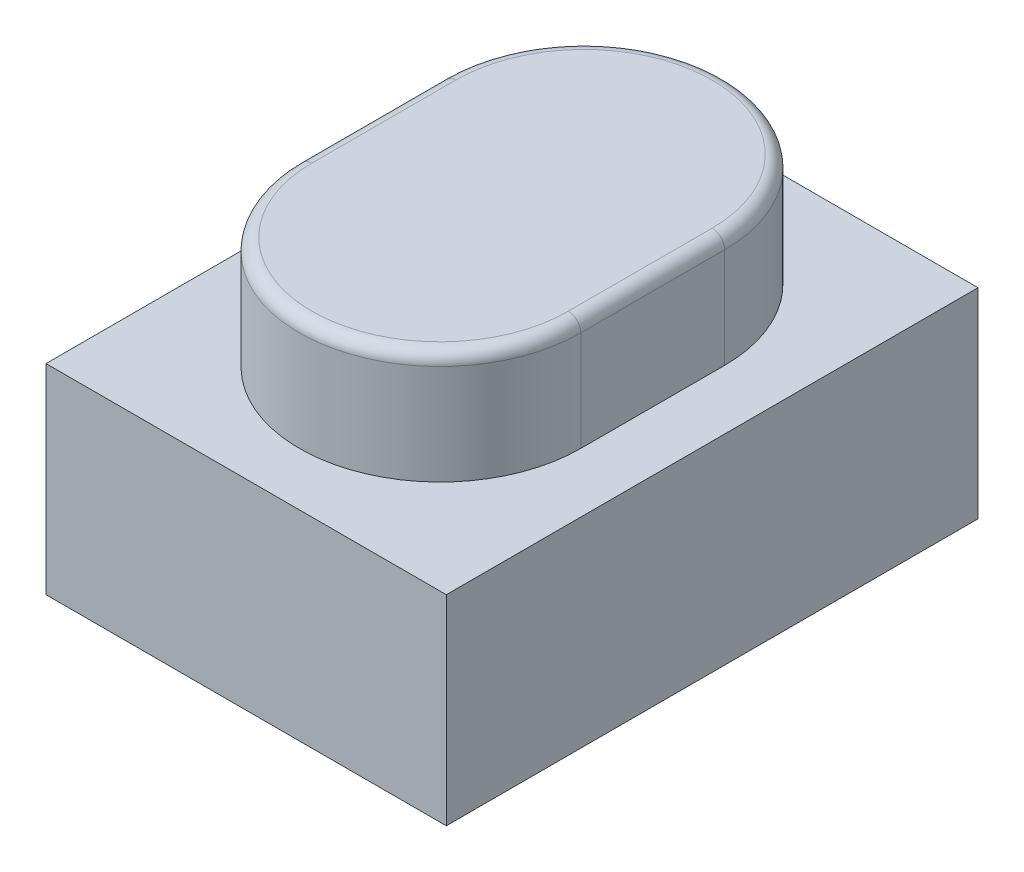
ISO-10303-21;
HEADER;
FILE_DESCRIPTION(('STEP AP214'),'2;1');
FILE_NAME('part.step','',(''),(''),'','','');
FILE_SCHEMA(('AUTOMOTIVE_DESIGN { 1 0 10303 214 1 1 1 1 }'));
ENDSEC;
DATA;
#1=APPLICATION_CONTEXT('core data for automotive mechanical design processes');
#2=APPLICATION_PROTOCOL_DEFINITION('international standard','automotive_design',2000,#1);
#3=PRODUCT_CONTEXT('',#1,'mechanical');
#4=PRODUCT('Part','Part','',(#3));
#5=PRODUCT_RELATED_PRODUCT_CATEGORY('part','',(#4));
#6=PRODUCT_DEFINITION_FORMATION('','',#4);
#7=PRODUCT_DEFINITION_CONTEXT('part definition',#1,'design');
#8=PRODUCT_DEFINITION('design','',#6,#7);
#9=PRODUCT_DEFINITION_SHAPE('','',#8);
#10=(LENGTH_UNIT() NAMED_UNIT(*) SI_UNIT(.MILLI.,.METRE.));
#11=(NAMED_UNIT(*) PLANE_ANGLE_UNIT() SI_UNIT($,.RADIAN.));
#12=(NAMED_UNIT(*) SI_UNIT($,.STERADIAN.) SOLID_ANGLE_UNIT());
#13=UNCERTAINTY_MEASURE_WITH_UNIT(LENGTH_MEASURE(1.E-05),#10,'distance_accuracy_value','');
#14=(GEOMETRIC_REPRESENTATION_CONTEXT(3) GLOBAL_UNCERTAINTY_ASSIGNED_CONTEXT((#13)) GLOBAL_UNIT_ASSIGNED_CONTEXT((#10,
#11,#12)) REPRESENTATION_CONTEXT('',''));
#15=CARTESIAN_POINT('',(0.,0.,0.));
#16=DIRECTION('',(0.,0.,1.));
#17=DIRECTION('',(1.,0.,0.));
#18=AXIS2_PLACEMENT_3D('',#15,#16,#17);
#19=CARTESIAN_POINT('',(1.6,1.6,-2.125));
#20=DIRECTION('',(-1.,0.,0.));
#21=DIRECTION('',(0.,0.,1.));
#22=AXIS2_PLACEMENT_3D('',#19,#20,#21);
#23=PLANE('',#22);
#24=DIRECTION('',(0.,0.,-1.));
#25=VECTOR('',#24,1.);
#26=CARTESIAN_POINT('',(1.6,0.,-2.125));
#27=LINE('',#26,#25);
#28=CARTESIAN_POINT('',(1.6,0.,2.125));
#29=VERTEX_POINT('',#28);
#30=CARTESIAN_POINT('',(1.6,0.,-2.125));
#31=VERTEX_POINT('',#30);
#32=EDGE_CURVE('E150',#29,#31,#27,.T.);
#33=ORIENTED_EDGE('',*,*,#32,.T.);
#34=DIRECTION('',(0.,-1.,0.));
#35=VECTOR('',#34,1.);
#36=CARTESIAN_POINT('',(1.6,1.6,-2.125));
#37=LINE('',#36,#35);
#38=CARTESIAN_POINT('',(1.6,1.6,-2.125));
#39=VERTEX_POINT('',#38);
#40=EDGE_CURVE('E177',#39,#31,#37,.T.);
#41=ORIENTED_EDGE('',*,*,#40,.F.);
#42=DIRECTION('',(0.,0.,-1.));
#43=VECTOR('',#42,1.);
#44=CARTESIAN_POINT('',(1.6,1.6,-2.125));
#45=LINE('',#44,#43);
#46=CARTESIAN_POINT('',(1.6,1.6,2.125));
#47=VERTEX_POINT('',#46);
#48=EDGE_CURVE('E151',#47,#39,#45,.T.);
#49=ORIENTED_EDGE('',*,*,#48,.F.);
#50=DIRECTION('',(0.,-1.,0.));
#51=VECTOR('',#50,1.);
#52=CARTESIAN_POINT('',(1.6,1.6,2.125));
#53=LINE('',#52,#51);
#54=EDGE_CURVE('E161',#47,#29,#53,.T.);
#55=ORIENTED_EDGE('',*,*,#54,.T.);
#56=EDGE_LOOP('',(#33,#41,#49,#55));
#57=FACE_BOUND('',#56,.T.);
#58=ADVANCED_FACE('F45',(#57),#23,.F.);
#59=CARTESIAN_POINT('',(-1.6,1.6,-2.125));
#60=DIRECTION('',(0.,0.,1.));
#61=DIRECTION('',(1.,0.,0.));
#62=AXIS2_PLACEMENT_3D('',#59,#60,#61);
#63=PLANE('',#62);
#64=DIRECTION('',(-1.,0.,0.));
#65=VECTOR('',#64,1.);
#66=CARTESIAN_POINT('',(-1.6,0.,-2.125));
#67=LINE('',#66,#65);
#68=CARTESIAN_POINT('',(-1.6,0.,-2.125));
#69=VERTEX_POINT('',#68);
#70=EDGE_CURVE('E164',#31,#69,#67,.T.);
#71=ORIENTED_EDGE('',*,*,#70,.T.);
#72=DIRECTION('',(0.,-1.,0.));
#73=VECTOR('',#72,1.);
#74=CARTESIAN_POINT('',(-1.6,1.6,-2.125));
#75=LINE('',#74,#73);
#76=CARTESIAN_POINT('',(-1.6,1.6,-2.125));
#77=VERTEX_POINT('',#76);
#78=EDGE_CURVE('E174',#77,#69,#75,.T.);
#79=ORIENTED_EDGE('',*,*,#78,.F.);
#80=DIRECTION('',(-1.,0.,0.));
#81=VECTOR('',#80,1.);
#82=CARTESIAN_POINT('',(-1.6,1.6,-2.125));
#83=LINE('',#82,#81);
#84=EDGE_CURVE('E154',#39,#77,#83,.T.);
#85=ORIENTED_EDGE('',*,*,#84,.F.);
#86=ORIENTED_EDGE('',*,*,#40,.T.);
#87=EDGE_LOOP('',(#71,#79,#85,#86));
#88=FACE_BOUND('',#87,.T.);
#89=ADVANCED_FACE('F232',(#88),#63,.F.);
#90=CARTESIAN_POINT('',(-1.6,1.6,-2.125));
#91=DIRECTION('',(1.,0.,0.));
#92=DIRECTION('',(0.,0.,-1.));
#93=AXIS2_PLACEMENT_3D('',#90,#91,#92);
#94=PLANE('',#93);
#95=DIRECTION('',(0.,0.,1.));
#96=VECTOR('',#95,1.);
#97=CARTESIAN_POINT('',(-1.6,0.,-2.125));
#98=LINE('',#97,#96);
#99=CARTESIAN_POINT('',(-1.6,0.,2.125));
#100=VERTEX_POINT('',#99);
#101=EDGE_CURVE('E166',#69,#100,#98,.T.);
#102=ORIENTED_EDGE('',*,*,#101,.T.);
#103=DIRECTION('',(0.,-1.,0.));
#104=VECTOR('',#103,1.);
#105=CARTESIAN_POINT('',(-1.6,1.6,2.125));
#106=LINE('',#105,#104);
#107=CARTESIAN_POINT('',(-1.6,1.6,2.125));
#108=VERTEX_POINT('',#107);
#109=EDGE_CURVE('E171',#108,#100,#106,.T.);
#110=ORIENTED_EDGE('',*,*,#109,.F.);
#111=DIRECTION('',(0.,0.,1.));
#112=VECTOR('',#111,1.);
#113=CARTESIAN_POINT('',(-1.6,1.6,-2.125));
#114=LINE('',#113,#112);
#115=EDGE_CURVE('E157',#77,#108,#114,.T.);
#116=ORIENTED_EDGE('',*,*,#115,.F.);
#117=ORIENTED_EDGE('',*,*,#78,.T.);
#118=EDGE_LOOP('',(#102,#110,#116,#117));
#119=FACE_BOUND('',#118,.T.);
#120=ADVANCED_FACE('F238',(#119),#94,.F.);
#121=CARTESIAN_POINT('',(-1.6,1.6,2.125));
#122=DIRECTION('',(0.,0.,-1.));
#123=DIRECTION('',(-1.,0.,0.));
#124=AXIS2_PLACEMENT_3D('',#121,#122,#123);
#125=PLANE('',#124);
#126=DIRECTION('',(1.,0.,0.));
#127=VECTOR('',#126,1.);
#128=CARTESIAN_POINT('',(-1.6,0.,2.125));
#129=LINE('',#128,#127);
#130=EDGE_CURVE('E155',#100,#29,#129,.T.);
#131=ORIENTED_EDGE('',*,*,#130,.T.);
#132=ORIENTED_EDGE('',*,*,#54,.F.);
#133=DIRECTION('',(1.,0.,0.));
#134=VECTOR('',#133,1.);
#135=CARTESIAN_POINT('',(-1.6,1.6,2.125));
#136=LINE('',#135,#134);
#137=EDGE_CURVE('E159',#108,#47,#136,.T.);
#138=ORIENTED_EDGE('',*,*,#137,.F.);
#139=ORIENTED_EDGE('',*,*,#109,.T.);
#140=EDGE_LOOP('',(#131,#132,#138,#139));
#141=FACE_BOUND('',#140,.T.);
#142=ADVANCED_FACE('F328',(#141),#125,.F.);
#143=CARTESIAN_POINT('',(0.,1.6,0.));
#144=DIRECTION('',(0.,1.,0.));
#145=DIRECTION('',(0.,0.,1.));
#146=AXIS2_PLACEMENT_3D('',#143,#144,#145);
#147=PLANE('',#146);
#148=CARTESIAN_POINT('',(0.,1.6,-0.575));
#149=DIRECTION('',(0.,1.,0.));
#150=DIRECTION('',(0.,0.,1.));
#151=AXIS2_PLACEMENT_3D('',#148,#149,#150);
#152=CIRCLE('',#151,1.125);
#153=CARTESIAN_POINT('',(1.125,1.6,-0.575000000000001));
#154=VERTEX_POINT('',#153);
#155=CARTESIAN_POINT('',(-1.125,1.6,-0.575));
#156=VERTEX_POINT('',#155);
#157=EDGE_CURVE('E141',#154,#156,#152,.T.);
#158=ORIENTED_EDGE('',*,*,#157,.F.);
#159=DIRECTION('',(0.,0.,-1.));
#160=VECTOR('',#159,1.);
#161=CARTESIAN_POINT('',(1.125,1.6,-0.575000000000001));
#162=LINE('',#161,#160);
#163=CARTESIAN_POINT('',(1.125,1.6,0.575));
#164=VERTEX_POINT('',#163);
#165=EDGE_CURVE('E138',#164,#154,#162,.T.);
#166=ORIENTED_EDGE('',*,*,#165,.F.);
#167=CARTESIAN_POINT('',(0.,1.6,0.575));
#168=DIRECTION('',(0.,1.,0.));
#169=DIRECTION('',(0.,0.,1.));
#170=AXIS2_PLACEMENT_3D('',#167,#168,#169);
#171=CIRCLE('',#170,1.125);
#172=CARTESIAN_POINT('',(-1.125,1.6,0.575));
#173=VERTEX_POINT('',#172);
#174=EDGE_CURVE('E124',#173,#164,#171,.T.);
#175=ORIENTED_EDGE('',*,*,#174,.F.);
#176=DIRECTION('',(0.,0.,1.));
#177=VECTOR('',#176,1.);
#178=CARTESIAN_POINT('',(-1.125,1.6,-0.575));
#179=LINE('',#178,#177);
#180=EDGE_CURVE('E135',#156,#173,#179,.T.);
#181=ORIENTED_EDGE('',*,*,#180,.F.);
#182=EDGE_LOOP('',(#158,#166,#175,#181));
#183=FACE_BOUND('',#182,.T.);
#184=ORIENTED_EDGE('',*,*,#48,.T.);
#185=ORIENTED_EDGE('',*,*,#84,.T.);
#186=ORIENTED_EDGE('',*,*,#115,.T.);
#187=ORIENTED_EDGE('',*,*,#137,.T.);
#188=EDGE_LOOP('',(#184,#185,#186,#187));
#189=FACE_BOUND('',#188,.T.);
#190=ADVANCED_FACE('F133',(#183,#189),#147,.T.);
#191=CARTESIAN_POINT('',(0.,0.,0.));
#192=DIRECTION('',(0.,1.,0.));
#193=DIRECTION('',(0.,0.,1.));
#194=AXIS2_PLACEMENT_3D('',#191,#192,#193);
#195=PLANE('',#194);
#196=ORIENTED_EDGE('',*,*,#32,.F.);
#197=ORIENTED_EDGE('',*,*,#130,.F.);
#198=ORIENTED_EDGE('',*,*,#101,.F.);
#199=ORIENTED_EDGE('',*,*,#70,.F.);
#200=EDGE_LOOP('',(#196,#197,#198,#199));
#201=FACE_BOUND('',#200,.T.);
#202=ADVANCED_FACE('F316',(#201),#195,.F.);
#203=CARTESIAN_POINT('',(0.,2.5,-0.575));
#204=DIRECTION('',(0.,-1.,0.));
#205=DIRECTION('',(0.,0.,-1.));
#206=AXIS2_PLACEMENT_3D('',#203,#204,#205);
#207=CYLINDRICAL_SURFACE('',#206,1.125);
#208=DIRECTION('',(0.,-1.,0.));
#209=VECTOR('',#208,1.);
#210=CARTESIAN_POINT('',(-1.125,2.5,-0.575));
#211=LINE('',#210,#209);
#212=CARTESIAN_POINT('',(-1.125,2.4,-0.575));
#213=VERTEX_POINT('',#212);
#214=EDGE_CURVE('E126',#213,#156,#211,.T.);
#215=ORIENTED_EDGE('',*,*,#214,.F.);
#216=CARTESIAN_POINT('',(0.,2.4,-0.575));
#217=DIRECTION('',(0.,1.,0.));
#218=DIRECTION('',(0.,0.,1.));
#219=AXIS2_PLACEMENT_3D('',#216,#217,#218);
#220=CIRCLE('',#219,1.125);
#221=CARTESIAN_POINT('',(1.125,2.4,-0.575000000000001));
#222=VERTEX_POINT('',#221);
#223=EDGE_CURVE('E11',#213,#222,#220,.F.);
#224=ORIENTED_EDGE('',*,*,#223,.T.);
#225=DIRECTION('',(0.,-1.,0.));
#226=VECTOR('',#225,1.);
#227=CARTESIAN_POINT('',(1.125,2.5,-0.575000000000001));
#228=LINE('',#227,#226);
#229=EDGE_CURVE('E146',#222,#154,#228,.T.);
#230=ORIENTED_EDGE('',*,*,#229,.T.);
#231=ORIENTED_EDGE('',*,*,#157,.T.);
#232=EDGE_LOOP('',(#215,#224,#230,#231));
#233=FACE_BOUND('',#232,.T.);
#234=ADVANCED_FACE('F215',(#233),#207,.T.);
#235=CARTESIAN_POINT('',(-1.125,2.5,-0.575));
#236=DIRECTION('',(1.,0.,0.));
#237=DIRECTION('',(0.,0.,-1.));
#238=AXIS2_PLACEMENT_3D('',#235,#236,#237);
#239=PLANE('',#238);
#240=DIRECTION('',(0.,-1.,0.));
#241=VECTOR('',#240,1.);
#242=CARTESIAN_POINT('',(-1.125,2.5,0.575));
#243=LINE('',#242,#241);
#244=CARTESIAN_POINT('',(-1.125,2.4,0.575));
#245=VERTEX_POINT('',#244);
#246=EDGE_CURVE('E121',#245,#173,#243,.T.);
#247=ORIENTED_EDGE('',*,*,#246,.F.);
#248=DIRECTION('',(0.,0.,1.));
#249=VECTOR('',#248,1.);
#250=CARTESIAN_POINT('',(-1.125,2.4,-0.575));
#251=LINE('',#250,#249);
#252=EDGE_CURVE('E54',#245,#213,#251,.F.);
#253=ORIENTED_EDGE('',*,*,#252,.T.);
#254=ORIENTED_EDGE('',*,*,#214,.T.);
#255=ORIENTED_EDGE('',*,*,#180,.T.);
#256=EDGE_LOOP('',(#247,#253,#254,#255));
#257=FACE_BOUND('',#256,.T.);
#258=ADVANCED_FACE('F140',(#257),#239,.F.);
#259=CARTESIAN_POINT('',(0.,2.5,0.575));
#260=DIRECTION('',(0.,-1.,0.));
#261=DIRECTION('',(0.,0.,-1.));
#262=AXIS2_PLACEMENT_3D('',#259,#260,#261);
#263=CYLINDRICAL_SURFACE('',#262,1.125);
#264=DIRECTION('',(0.,-1.,0.));
#265=VECTOR('',#264,1.);
#266=CARTESIAN_POINT('',(1.125,2.5,0.575));
#267=LINE('',#266,#265);
#268=CARTESIAN_POINT('',(1.125,2.4,0.575));
#269=VERTEX_POINT('',#268);
#270=EDGE_CURVE('E127',#269,#164,#267,.T.);
#271=ORIENTED_EDGE('',*,*,#270,.F.);
#272=CARTESIAN_POINT('',(0.,2.4,0.575));
#273=DIRECTION('',(0.,1.,0.));
#274=DIRECTION('',(0.,0.,1.));
#275=AXIS2_PLACEMENT_3D('',#272,#273,#274);
#276=CIRCLE('',#275,1.125);
#277=EDGE_CURVE('E69',#269,#245,#276,.F.);
#278=ORIENTED_EDGE('',*,*,#277,.T.);
#279=ORIENTED_EDGE('',*,*,#246,.T.);
#280=ORIENTED_EDGE('',*,*,#174,.T.);
#281=EDGE_LOOP('',(#271,#278,#279,#280));
#282=FACE_BOUND('',#281,.T.);
#283=ADVANCED_FACE('F123',(#282),#263,.T.);
#284=CARTESIAN_POINT('',(1.125,2.5,-0.575000000000001));
#285=DIRECTION('',(-1.,0.,0.));
#286=DIRECTION('',(0.,0.,1.));
#287=AXIS2_PLACEMENT_3D('',#284,#285,#286);
#288=PLANE('',#287);
#289=ORIENTED_EDGE('',*,*,#229,.F.);
#290=DIRECTION('',(0.,0.,-1.));
#291=VECTOR('',#290,1.);
#292=CARTESIAN_POINT('',(1.125,2.4,0.575));
#293=LINE('',#292,#291);
#294=EDGE_CURVE('E189',#222,#269,#293,.F.);
#295=ORIENTED_EDGE('',*,*,#294,.T.);
#296=ORIENTED_EDGE('',*,*,#270,.T.);
#297=ORIENTED_EDGE('',*,*,#165,.T.);
#298=EDGE_LOOP('',(#289,#295,#296,#297));
#299=FACE_BOUND('',#298,.T.);
#300=ADVANCED_FACE('F218',(#299),#288,.F.);
#301=CARTESIAN_POINT('',(0.,2.5,-0.575));
#302=DIRECTION('',(0.,1.,0.));
#303=DIRECTION('',(0.,0.,1.));
#304=AXIS2_PLACEMENT_3D('',#301,#302,#303);
#305=PLANE('',#304);
#306=CARTESIAN_POINT('',(0.,2.5,0.575));
#307=DIRECTION('',(0.,1.,0.));
#308=DIRECTION('',(0.,0.,1.));
#309=AXIS2_PLACEMENT_3D('',#306,#307,#308);
#310=CIRCLE('',#309,1.025);
#311=CARTESIAN_POINT('',(-1.025,2.5,0.575));
#312=VERTEX_POINT('',#311);
#313=CARTESIAN_POINT('',(1.025,2.5,0.575));
#314=VERTEX_POINT('',#313);
#315=EDGE_CURVE('E184',#312,#314,#310,.T.);
#316=ORIENTED_EDGE('',*,*,#315,.T.);
#317=DIRECTION('',(0.,0.,-1.));
#318=VECTOR('',#317,1.);
#319=CARTESIAN_POINT('',(1.025,2.5,-0.575000000000001));
#320=LINE('',#319,#318);
#321=CARTESIAN_POINT('',(1.025,2.5,-0.575000000000001));
#322=VERTEX_POINT('',#321);
#323=EDGE_CURVE('E186',#314,#322,#320,.T.);
#324=ORIENTED_EDGE('',*,*,#323,.T.);
#325=CARTESIAN_POINT('',(0.,2.5,-0.575));
#326=DIRECTION('',(0.,1.,0.));
#327=DIRECTION('',(0.,0.,1.));
#328=AXIS2_PLACEMENT_3D('',#325,#326,#327);
#329=CIRCLE('',#328,1.025);
#330=CARTESIAN_POINT('',(-1.025,2.5,-0.575));
#331=VERTEX_POINT('',#330);
#332=EDGE_CURVE('E180',#322,#331,#329,.T.);
#333=ORIENTED_EDGE('',*,*,#332,.T.);
#334=DIRECTION('',(0.,0.,1.));
#335=VECTOR('',#334,1.);
#336=CARTESIAN_POINT('',(-1.025,2.5,0.575));
#337=LINE('',#336,#335);
#338=EDGE_CURVE('E182',#331,#312,#337,.T.);
#339=ORIENTED_EDGE('',*,*,#338,.T.);
#340=EDGE_LOOP('',(#316,#324,#333,#339));
#341=FACE_BOUND('',#340,.T.);
#342=ADVANCED_FACE('F223',(#341),#305,.T.);
#343=CARTESIAN_POINT('',(-1.025,2.4,-0.575));
#344=DIRECTION('',(0.,0.,-1.));
#345=DIRECTION('',(-1.,0.,0.));
#346=AXIS2_PLACEMENT_3D('',#343,#344,#345);
#347=CYLINDRICAL_SURFACE('',#346,0.1);
#348=CARTESIAN_POINT('',(-1.025,2.4,-0.575));
#349=DIRECTION('',(0.,0.,-1.));
#350=DIRECTION('',(-1.,0.,0.));
#351=AXIS2_PLACEMENT_3D('',#348,#349,#350);
#352=CIRCLE('',#351,0.1);
#353=EDGE_CURVE('E197',#213,#331,#352,.T.);
#354=ORIENTED_EDGE('',*,*,#353,.F.);
#355=ORIENTED_EDGE('',*,*,#252,.F.);
#356=CARTESIAN_POINT('',(-1.025,2.4,0.575));
#357=DIRECTION('',(0.,0.,1.));
#358=DIRECTION('',(1.,0.,0.));
#359=AXIS2_PLACEMENT_3D('',#356,#357,#358);
#360=CIRCLE('',#359,0.1);
#361=EDGE_CURVE('E49',#312,#245,#360,.T.);
#362=ORIENTED_EDGE('',*,*,#361,.F.);
#363=ORIENTED_EDGE('',*,*,#338,.F.);
#364=EDGE_LOOP('',(#354,#355,#362,#363));
#365=FACE_BOUND('',#364,.T.);
#366=ADVANCED_FACE('F47',(#365),#347,.T.);
#367=CARTESIAN_POINT('',(0.,2.4,0.575));
#368=DIRECTION('',(0.,1.,0.));
#369=DIRECTION('',(0.,0.,1.));
#370=AXIS2_PLACEMENT_3D('',#367,#368,#369);
#371=TOROIDAL_SURFACE('',#370,1.025,0.1);
#372=ORIENTED_EDGE('',*,*,#361,.T.);
#373=ORIENTED_EDGE('',*,*,#277,.F.);
#374=CARTESIAN_POINT('',(1.025,2.4,0.575));
#375=DIRECTION('',(0.,0.,-1.));
#376=DIRECTION('',(-1.,0.,0.));
#377=AXIS2_PLACEMENT_3D('',#374,#375,#376);
#378=CIRCLE('',#377,0.1);
#379=EDGE_CURVE('E196',#314,#269,#378,.T.);
#380=ORIENTED_EDGE('',*,*,#379,.F.);
#381=ORIENTED_EDGE('',*,*,#315,.F.);
#382=EDGE_LOOP('',(#372,#373,#380,#381));
#383=FACE_BOUND('',#382,.T.);
#384=ADVANCED_FACE('F207',(#383),#371,.T.);
#385=CARTESIAN_POINT('',(0.,2.4,-0.575));
#386=DIRECTION('',(0.,1.,0.));
#387=DIRECTION('',(0.,0.,1.));
#388=AXIS2_PLACEMENT_3D('',#385,#386,#387);
#389=TOROIDAL_SURFACE('',#388,1.025,0.1);
#390=ORIENTED_EDGE('',*,*,#353,.T.);
#391=ORIENTED_EDGE('',*,*,#332,.F.);
#392=CARTESIAN_POINT('',(1.025,2.4,-0.575000000000001));
#393=DIRECTION('',(0.,0.,1.));
#394=DIRECTION('',(1.,0.,0.));
#395=AXIS2_PLACEMENT_3D('',#392,#393,#394);
#396=CIRCLE('',#395,0.1);
#397=EDGE_CURVE('E194',#222,#322,#396,.T.);
#398=ORIENTED_EDGE('',*,*,#397,.F.);
#399=ORIENTED_EDGE('',*,*,#223,.F.);
#400=EDGE_LOOP('',(#390,#391,#398,#399));
#401=FACE_BOUND('',#400,.T.);
#402=ADVANCED_FACE('F212',(#401),#389,.T.);
#403=CARTESIAN_POINT('',(1.025,2.4,-0.575));
#404=DIRECTION('',(0.,0.,1.));
#405=DIRECTION('',(1.,0.,0.));
#406=AXIS2_PLACEMENT_3D('',#403,#404,#405);
#407=CYLINDRICAL_SURFACE('',#406,0.1);
#408=ORIENTED_EDGE('',*,*,#379,.T.);
#409=ORIENTED_EDGE('',*,*,#294,.F.);
#410=ORIENTED_EDGE('',*,*,#397,.T.);
#411=ORIENTED_EDGE('',*,*,#323,.F.);
#412=EDGE_LOOP('',(#408,#409,#410,#411));
#413=FACE_BOUND('',#412,.T.);
#414=ADVANCED_FACE('F220',(#413),#407,.T.);
#415=CLOSED_SHELL('',(#58,#89,#120,#142,#190,#202,#234,#258,#283,#300,#342,#366,#384,#402,#414));
#416=MANIFOLD_SOLID_BREP('B2',#415);
#417=ADVANCED_BREP_SHAPE_REPRESENTATION('',(#18,#416),#14);
#418=SHAPE_DEFINITION_REPRESENTATION(#9,#417);
ENDSEC;
END-ISO-10303-21;
